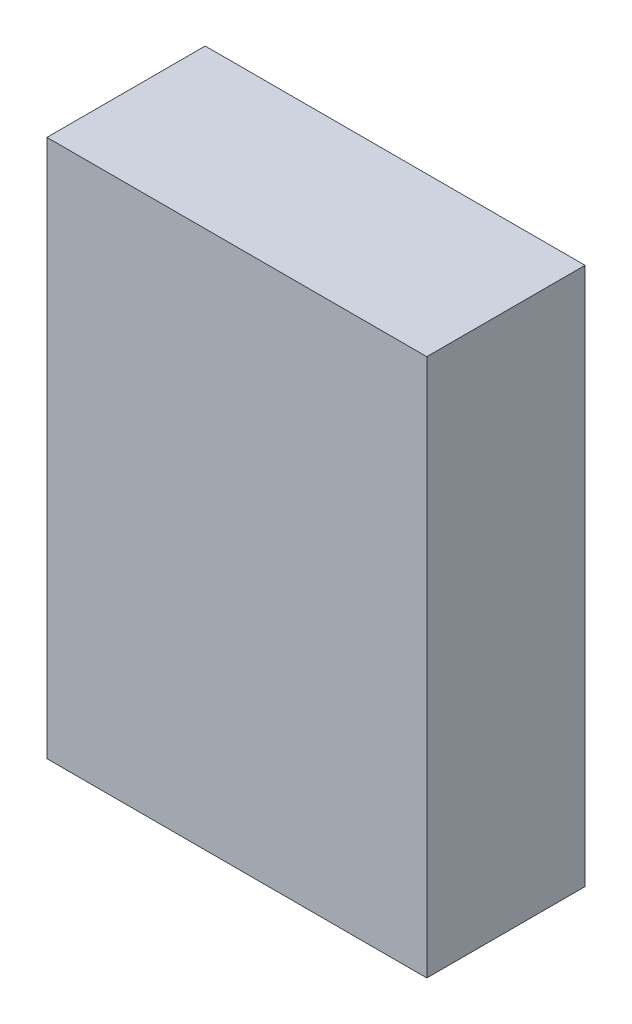
ISO-10303-21;
HEADER;
FILE_DESCRIPTION(('STEP AP214'),'2;1');
FILE_NAME('part.step','',(''),(''),'','','');
FILE_SCHEMA(('AUTOMOTIVE_DESIGN { 1 0 10303 214 1 1 1 1 }'));
ENDSEC;
DATA;
#1=APPLICATION_CONTEXT('core data for automotive mechanical design processes');
#2=APPLICATION_PROTOCOL_DEFINITION('international standard','automotive_design',2000,#1);
#3=PRODUCT_CONTEXT('',#1,'mechanical');
#4=PRODUCT('Part','Part','',(#3));
#5=PRODUCT_RELATED_PRODUCT_CATEGORY('part','',(#4));
#6=PRODUCT_DEFINITION_FORMATION('','',#4);
#7=PRODUCT_DEFINITION_CONTEXT('part definition',#1,'design');
#8=PRODUCT_DEFINITION('design','',#6,#7);
#9=PRODUCT_DEFINITION_SHAPE('','',#8);
#10=(LENGTH_UNIT() NAMED_UNIT(*) SI_UNIT(.MILLI.,.METRE.));
#11=(NAMED_UNIT(*) PLANE_ANGLE_UNIT() SI_UNIT($,.RADIAN.));
#12=(NAMED_UNIT(*) SI_UNIT($,.STERADIAN.) SOLID_ANGLE_UNIT());
#13=UNCERTAINTY_MEASURE_WITH_UNIT(LENGTH_MEASURE(1.E-05),#10,'distance_accuracy_value','');
#14=(GEOMETRIC_REPRESENTATION_CONTEXT(3) GLOBAL_UNCERTAINTY_ASSIGNED_CONTEXT((#13)) GLOBAL_UNIT_ASSIGNED_CONTEXT((#10,
#11,#12)) REPRESENTATION_CONTEXT('',''));
#15=CARTESIAN_POINT('',(0.,0.,0.));
#16=DIRECTION('',(0.,0.,1.));
#17=DIRECTION('',(1.,0.,0.));
#18=AXIS2_PLACEMENT_3D('',#15,#16,#17);
#19=CARTESIAN_POINT('',(-0.87,-2.92,0.));
#20=DIRECTION('',(1.,0.,0.));
#21=DIRECTION('',(0.,0.,1.));
#22=AXIS2_PLACEMENT_3D('',#19,#20,#21);
#23=PLANE('',#22);
#24=DIRECTION('',(0.,1.,0.));
#25=VECTOR('',#24,1.);
#26=CARTESIAN_POINT('',(-0.87,-2.92,0.1));
#27=LINE('',#26,#25);
#28=CARTESIAN_POINT('',(-0.87,-2.92,0.1));
#29=VERTEX_POINT('',#28);
#30=CARTESIAN_POINT('',(-0.87,-2.58,0.1));
#31=VERTEX_POINT('',#30);
#32=EDGE_CURVE('E11',#29,#31,#27,.T.);
#33=ORIENTED_EDGE('',*,*,#32,.T.);
#34=DIRECTION('',(0.,0.,1.));
#35=VECTOR('',#34,1.);
#36=CARTESIAN_POINT('',(-0.87,-2.58,0.));
#37=LINE('',#36,#35);
#38=CARTESIAN_POINT('',(-0.87,-2.58,0.));
#39=VERTEX_POINT('',#38);
#40=EDGE_CURVE('E24',#39,#31,#37,.T.);
#41=ORIENTED_EDGE('',*,*,#40,.F.);
#42=DIRECTION('',(0.,1.,0.));
#43=VECTOR('',#42,1.);
#44=CARTESIAN_POINT('',(-0.87,-2.92,0.));
#45=LINE('',#44,#43);
#46=CARTESIAN_POINT('',(-0.87,-2.92,0.));
#47=VERTEX_POINT('',#46);
#48=EDGE_CURVE('E86',#47,#39,#45,.T.);
#49=ORIENTED_EDGE('',*,*,#48,.F.);
#50=DIRECTION('',(0.,0.,1.));
#51=VECTOR('',#50,1.);
#52=CARTESIAN_POINT('',(-0.87,-2.92,0.));
#53=LINE('',#52,#51);
#54=EDGE_CURVE('E36',#47,#29,#53,.T.);
#55=ORIENTED_EDGE('',*,*,#54,.T.);
#56=EDGE_LOOP('',(#33,#41,#49,#55));
#57=FACE_BOUND('',#56,.T.);
#58=ADVANCED_FACE('F17',(#57),#23,.F.);
#59=CARTESIAN_POINT('',(-0.63,-2.92,0.));
#60=DIRECTION('',(1.,0.,0.));
#61=DIRECTION('',(0.,0.,1.));
#62=AXIS2_PLACEMENT_3D('',#59,#60,#61);
#63=PLANE('',#62);
#64=DIRECTION('',(0.,0.,1.));
#65=VECTOR('',#64,1.);
#66=CARTESIAN_POINT('',(-0.63,-2.92,0.));
#67=LINE('',#66,#65);
#68=CARTESIAN_POINT('',(-0.63,-2.92,0.));
#69=VERTEX_POINT('',#68);
#70=CARTESIAN_POINT('',(-0.63,-2.92,0.1));
#71=VERTEX_POINT('',#70);
#72=EDGE_CURVE('E83',#69,#71,#67,.T.);
#73=ORIENTED_EDGE('',*,*,#72,.F.);
#74=DIRECTION('',(0.,1.,0.));
#75=VECTOR('',#74,1.);
#76=CARTESIAN_POINT('',(-0.63,-2.92,0.));
#77=LINE('',#76,#75);
#78=CARTESIAN_POINT('',(-0.63,-2.58,0.));
#79=VERTEX_POINT('',#78);
#80=EDGE_CURVE('E63',#69,#79,#77,.T.);
#81=ORIENTED_EDGE('',*,*,#80,.T.);
#82=DIRECTION('',(0.,0.,1.));
#83=VECTOR('',#82,1.);
#84=CARTESIAN_POINT('',(-0.63,-2.58,0.));
#85=LINE('',#84,#83);
#86=CARTESIAN_POINT('',(-0.63,-2.58,0.1));
#87=VERTEX_POINT('',#86);
#88=EDGE_CURVE('E57',#79,#87,#85,.T.);
#89=ORIENTED_EDGE('',*,*,#88,.T.);
#90=DIRECTION('',(0.,1.,0.));
#91=VECTOR('',#90,1.);
#92=CARTESIAN_POINT('',(-0.63,-2.92,0.1));
#93=LINE('',#92,#91);
#94=EDGE_CURVE('E60',#71,#87,#93,.T.);
#95=ORIENTED_EDGE('',*,*,#94,.F.);
#96=EDGE_LOOP('',(#73,#81,#89,#95));
#97=FACE_BOUND('',#96,.T.);
#98=ADVANCED_FACE('F59',(#97),#63,.T.);
#99=CARTESIAN_POINT('',(-0.87,-2.92,0.));
#100=DIRECTION('',(0.,1.,0.));
#101=DIRECTION('',(0.,0.,1.));
#102=AXIS2_PLACEMENT_3D('',#99,#100,#101);
#103=PLANE('',#102);
#104=ORIENTED_EDGE('',*,*,#72,.T.);
#105=DIRECTION('',(1.,0.,0.));
#106=VECTOR('',#105,1.);
#107=CARTESIAN_POINT('',(-0.87,-2.92,0.1));
#108=LINE('',#107,#106);
#109=EDGE_CURVE('E71',#29,#71,#108,.T.);
#110=ORIENTED_EDGE('',*,*,#109,.F.);
#111=ORIENTED_EDGE('',*,*,#54,.F.);
#112=DIRECTION('',(1.,0.,0.));
#113=VECTOR('',#112,1.);
#114=CARTESIAN_POINT('',(-0.87,-2.92,0.));
#115=LINE('',#114,#113);
#116=EDGE_CURVE('E76',#47,#69,#115,.T.);
#117=ORIENTED_EDGE('',*,*,#116,.T.);
#118=EDGE_LOOP('',(#104,#110,#111,#117));
#119=FACE_BOUND('',#118,.T.);
#120=ADVANCED_FACE('F91',(#119),#103,.F.);
#121=CARTESIAN_POINT('',(-0.87,-2.58,0.));
#122=DIRECTION('',(0.,1.,0.));
#123=DIRECTION('',(0.,0.,1.));
#124=AXIS2_PLACEMENT_3D('',#121,#122,#123);
#125=PLANE('',#124);
#126=DIRECTION('',(1.,0.,0.));
#127=VECTOR('',#126,1.);
#128=CARTESIAN_POINT('',(-0.87,-2.58,0.));
#129=LINE('',#128,#127);
#130=EDGE_CURVE('E74',#39,#79,#129,.T.);
#131=ORIENTED_EDGE('',*,*,#130,.F.);
#132=ORIENTED_EDGE('',*,*,#40,.T.);
#133=DIRECTION('',(1.,0.,0.));
#134=VECTOR('',#133,1.);
#135=CARTESIAN_POINT('',(-0.87,-2.58,0.1));
#136=LINE('',#135,#134);
#137=EDGE_CURVE('E69',#31,#87,#136,.T.);
#138=ORIENTED_EDGE('',*,*,#137,.T.);
#139=ORIENTED_EDGE('',*,*,#88,.F.);
#140=EDGE_LOOP('',(#131,#132,#138,#139));
#141=FACE_BOUND('',#140,.T.);
#142=ADVANCED_FACE('F73',(#141),#125,.T.);
#143=CARTESIAN_POINT('',(-0.87,-2.92,0.));
#144=DIRECTION('',(0.,0.,1.));
#145=DIRECTION('',(1.,0.,0.));
#146=AXIS2_PLACEMENT_3D('',#143,#144,#145);
#147=PLANE('',#146);
#148=ORIENTED_EDGE('',*,*,#130,.T.);
#149=ORIENTED_EDGE('',*,*,#80,.F.);
#150=ORIENTED_EDGE('',*,*,#116,.F.);
#151=ORIENTED_EDGE('',*,*,#48,.T.);
#152=EDGE_LOOP('',(#148,#149,#150,#151));
#153=FACE_BOUND('',#152,.T.);
#154=ADVANCED_FACE('F89',(#153),#147,.F.);
#155=CARTESIAN_POINT('',(-0.87,-2.92,0.1));
#156=DIRECTION('',(0.,0.,1.));
#157=DIRECTION('',(1.,0.,0.));
#158=AXIS2_PLACEMENT_3D('',#155,#156,#157);
#159=PLANE('',#158);
#160=ORIENTED_EDGE('',*,*,#32,.F.);
#161=ORIENTED_EDGE('',*,*,#109,.T.);
#162=ORIENTED_EDGE('',*,*,#94,.T.);
#163=ORIENTED_EDGE('',*,*,#137,.F.);
#164=EDGE_LOOP('',(#160,#161,#162,#163));
#165=FACE_BOUND('',#164,.T.);
#166=ADVANCED_FACE('F68',(#165),#159,.T.);
#167=CLOSED_SHELL('',(#58,#98,#120,#142,#154,#166));
#168=MANIFOLD_SOLID_BREP('B1',#167);
#169=ADVANCED_BREP_SHAPE_REPRESENTATION('',(#18,#168),#14);
#170=SHAPE_DEFINITION_REPRESENTATION(#9,#169);
ENDSEC;
END-ISO-10303-21;
